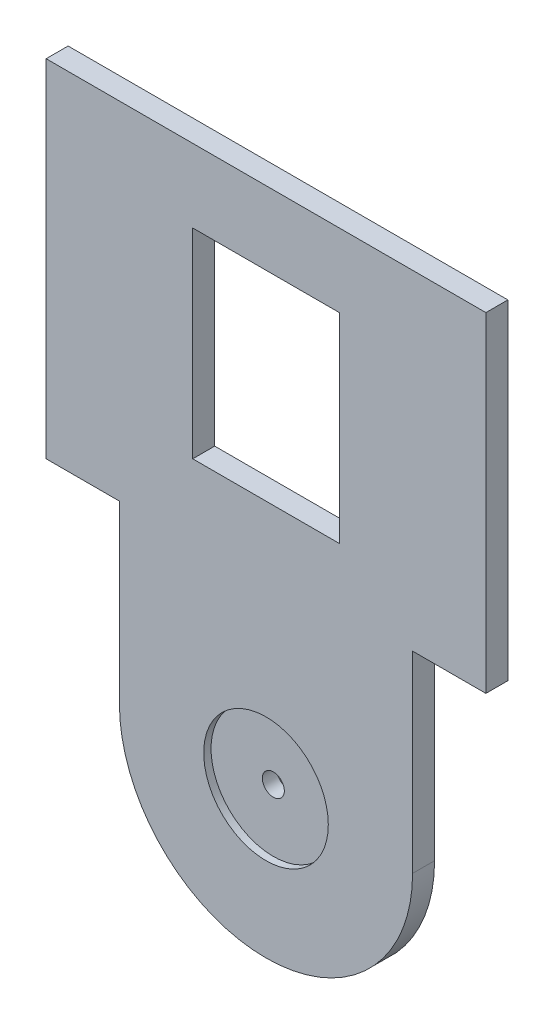
ISO-10303-21;
HEADER;
FILE_DESCRIPTION(('STEP AP214'),'2;1');
FILE_NAME('part.step','',(''),(''),'','','');
FILE_SCHEMA(('AUTOMOTIVE_DESIGN { 1 0 10303 214 1 1 1 1 }'));
ENDSEC;
DATA;
#1=APPLICATION_CONTEXT('core data for automotive mechanical design processes');
#2=APPLICATION_PROTOCOL_DEFINITION('international standard','automotive_design',2000,#1);
#3=PRODUCT_CONTEXT('',#1,'mechanical');
#4=PRODUCT('Part','Part','',(#3));
#5=PRODUCT_RELATED_PRODUCT_CATEGORY('part','',(#4));
#6=PRODUCT_DEFINITION_FORMATION('','',#4);
#7=PRODUCT_DEFINITION_CONTEXT('part definition',#1,'design');
#8=PRODUCT_DEFINITION('design','',#6,#7);
#9=PRODUCT_DEFINITION_SHAPE('','',#8);
#10=(LENGTH_UNIT() NAMED_UNIT(*) SI_UNIT(.MILLI.,.METRE.));
#11=(NAMED_UNIT(*) PLANE_ANGLE_UNIT() SI_UNIT($,.RADIAN.));
#12=(NAMED_UNIT(*) SI_UNIT($,.STERADIAN.) SOLID_ANGLE_UNIT());
#13=UNCERTAINTY_MEASURE_WITH_UNIT(LENGTH_MEASURE(1.E-05),#10,'distance_accuracy_value','');
#14=(GEOMETRIC_REPRESENTATION_CONTEXT(3) GLOBAL_UNCERTAINTY_ASSIGNED_CONTEXT((#13)) GLOBAL_UNIT_ASSIGNED_CONTEXT((#10,
#11,#12)) REPRESENTATION_CONTEXT('',''));
#15=CARTESIAN_POINT('',(0.,0.,0.));
#16=DIRECTION('',(0.,0.,1.));
#17=DIRECTION('',(1.,0.,0.));
#18=AXIS2_PLACEMENT_3D('',#15,#16,#17);
#19=CARTESIAN_POINT('',(-93.991811362998,10.9707882048787,3.));
#20=DIRECTION('',(0.,0.,-1.));
#21=DIRECTION('',(-1.,0.,0.));
#22=AXIS2_PLACEMENT_3D('',#19,#20,#21);
#23=CYLINDRICAL_SURFACE('',#22,1.5);
#24=CARTESIAN_POINT('',(-93.991811362998,10.9707882048787,0.));
#25=DIRECTION('',(0.,0.,1.));
#26=DIRECTION('',(1.,0.,0.));
#27=AXIS2_PLACEMENT_3D('',#24,#25,#26);
#28=CIRCLE('',#27,1.5);
#29=CARTESIAN_POINT('',(-92.491811362998,10.9707882048787,0.));
#30=VERTEX_POINT('',#29);
#31=EDGE_CURVE('E139',#30,#30,#28,.T.);
#32=ORIENTED_EDGE('',*,*,#31,.F.);
#33=EDGE_LOOP('',(#32));
#34=FACE_BOUND('',#33,.T.);
#35=CARTESIAN_POINT('',(-93.991811362998,10.9707882048787,2.));
#36=DIRECTION('',(0.,0.,1.));
#37=DIRECTION('',(1.,0.,0.));
#38=AXIS2_PLACEMENT_3D('',#35,#36,#37);
#39=CIRCLE('',#38,1.5);
#40=CARTESIAN_POINT('',(-92.491811362998,10.9707882048787,2.));
#41=VERTEX_POINT('',#40);
#42=EDGE_CURVE('E37',#41,#41,#39,.T.);
#43=ORIENTED_EDGE('',*,*,#42,.T.);
#44=EDGE_LOOP('',(#43));
#45=FACE_BOUND('',#44,.T.);
#46=ADVANCED_FACE('F33',(#34,#45),#23,.F.);
#47=CARTESIAN_POINT('',(-93.991811362998,10.9707882048787,3.));
#48=DIRECTION('',(0.,0.,1.));
#49=DIRECTION('',(1.,0.,0.));
#50=AXIS2_PLACEMENT_3D('',#47,#48,#49);
#51=PLANE('',#50);
#52=CARTESIAN_POINT('',(-93.991811362998,10.9707882048787,3.));
#53=DIRECTION('',(0.,0.,1.));
#54=DIRECTION('',(1.,0.,0.));
#55=AXIS2_PLACEMENT_3D('',#52,#53,#54);
#56=CIRCLE('',#55,8.50000000000001);
#57=CARTESIAN_POINT('',(-85.491811362998,10.9707882048787,3.));
#58=VERTEX_POINT('',#57);
#59=EDGE_CURVE('E313',#58,#58,#56,.T.);
#60=ORIENTED_EDGE('',*,*,#59,.F.);
#61=EDGE_LOOP('',(#60));
#62=FACE_BOUND('',#61,.T.);
#63=CARTESIAN_POINT('',(-93.991811362998,10.9707882048787,3.));
#64=DIRECTION('',(0.,0.,1.));
#65=DIRECTION('',(1.,0.,0.));
#66=AXIS2_PLACEMENT_3D('',#63,#64,#65);
#67=CIRCLE('',#66,20.);
#68=CARTESIAN_POINT('',(-113.991811362998,10.9707882048787,3.));
#69=VERTEX_POINT('',#68);
#70=CARTESIAN_POINT('',(-73.991811362998,10.9707882048787,3.));
#71=VERTEX_POINT('',#70);
#72=EDGE_CURVE('E164',#69,#71,#67,.T.);
#73=ORIENTED_EDGE('',*,*,#72,.T.);
#74=DIRECTION('',(0.,1.,0.));
#75=VECTOR('',#74,1.);
#76=CARTESIAN_POINT('',(-73.991811362998,10.9707882048787,3.));
#77=LINE('',#76,#75);
#78=CARTESIAN_POINT('',(-73.991811362998,37.236637471383,3.));
#79=VERTEX_POINT('',#78);
#80=EDGE_CURVE('E167',#71,#79,#77,.T.);
#81=ORIENTED_EDGE('',*,*,#80,.T.);
#82=DIRECTION('',(1.,0.,0.));
#83=VECTOR('',#82,1.);
#84=CARTESIAN_POINT('',(-73.991811362998,37.236637471383,3.));
#85=LINE('',#84,#83);
#86=CARTESIAN_POINT('',(-63.991811362998,37.236637471383,3.));
#87=VERTEX_POINT('',#86);
#88=EDGE_CURVE('E170',#79,#87,#85,.T.);
#89=ORIENTED_EDGE('',*,*,#88,.T.);
#90=DIRECTION('',(0.,1.,0.));
#91=VECTOR('',#90,1.);
#92=CARTESIAN_POINT('',(-63.991811362998,37.236637471383,3.));
#93=LINE('',#92,#91);
#94=CARTESIAN_POINT('',(-63.991811362998,82.236637471383,3.));
#95=VERTEX_POINT('',#94);
#96=EDGE_CURVE('E172',#87,#95,#93,.T.);
#97=ORIENTED_EDGE('',*,*,#96,.T.);
#98=DIRECTION('',(-1.,0.,0.));
#99=VECTOR('',#98,1.);
#100=CARTESIAN_POINT('',(-123.991811362998,82.2366374713831,3.));
#101=LINE('',#100,#99);
#102=CARTESIAN_POINT('',(-123.991811362998,82.2366374713831,3.));
#103=VERTEX_POINT('',#102);
#104=EDGE_CURVE('E174',#95,#103,#101,.T.);
#105=ORIENTED_EDGE('',*,*,#104,.T.);
#106=DIRECTION('',(0.,-1.,0.));
#107=VECTOR('',#106,1.);
#108=CARTESIAN_POINT('',(-123.991811362998,34.9581087916753,3.));
#109=LINE('',#108,#107);
#110=CARTESIAN_POINT('',(-123.991811362998,34.9581087916753,3.));
#111=VERTEX_POINT('',#110);
#112=EDGE_CURVE('E176',#103,#111,#109,.T.);
#113=ORIENTED_EDGE('',*,*,#112,.T.);
#114=DIRECTION('',(1.,0.,0.));
#115=VECTOR('',#114,1.);
#116=CARTESIAN_POINT('',(-113.991811362998,34.9581087916753,3.));
#117=LINE('',#116,#115);
#118=CARTESIAN_POINT('',(-113.991811362998,34.9581087916753,3.));
#119=VERTEX_POINT('',#118);
#120=EDGE_CURVE('E178',#111,#119,#117,.T.);
#121=ORIENTED_EDGE('',*,*,#120,.T.);
#122=DIRECTION('',(0.,-1.,0.));
#123=VECTOR('',#122,1.);
#124=CARTESIAN_POINT('',(-113.991811362998,10.9707882048787,3.));
#125=LINE('',#124,#123);
#126=EDGE_CURVE('E180',#119,#69,#125,.T.);
#127=ORIENTED_EDGE('',*,*,#126,.T.);
#128=EDGE_LOOP('',(#73,#81,#89,#97,#105,#113,#121,#127));
#129=FACE_BOUND('',#128,.T.);
#130=DIRECTION('',(1.,0.,0.));
#131=VECTOR('',#130,1.);
#132=CARTESIAN_POINT('',(-103.991811362998,44.9581087916753,3.));
#133=LINE('',#132,#131);
#134=CARTESIAN_POINT('',(-103.991811362998,44.9581087916753,3.));
#135=VERTEX_POINT('',#134);
#136=CARTESIAN_POINT('',(-83.991811362998,44.9581087916753,3.));
#137=VERTEX_POINT('',#136);
#138=EDGE_CURVE('E131',#135,#137,#133,.T.);
#139=ORIENTED_EDGE('',*,*,#138,.F.);
#140=DIRECTION('',(0.,-1.,0.));
#141=VECTOR('',#140,1.);
#142=CARTESIAN_POINT('',(-103.991811362998,72.236637471383,3.));
#143=LINE('',#142,#141);
#144=CARTESIAN_POINT('',(-103.991811362998,72.236637471383,3.));
#145=VERTEX_POINT('',#144);
#146=EDGE_CURVE('E123',#145,#135,#143,.T.);
#147=ORIENTED_EDGE('',*,*,#146,.F.);
#148=DIRECTION('',(-1.,0.,0.));
#149=VECTOR('',#148,1.);
#150=CARTESIAN_POINT('',(-103.991811362998,72.236637471383,3.));
#151=LINE('',#150,#149);
#152=CARTESIAN_POINT('',(-83.991811362998,72.236637471383,3.));
#153=VERTEX_POINT('',#152);
#154=EDGE_CURVE('E146',#153,#145,#151,.T.);
#155=ORIENTED_EDGE('',*,*,#154,.F.);
#156=DIRECTION('',(0.,1.,0.));
#157=VECTOR('',#156,1.);
#158=CARTESIAN_POINT('',(-83.991811362998,72.236637471383,3.));
#159=LINE('',#158,#157);
#160=EDGE_CURVE('E144',#137,#153,#159,.T.);
#161=ORIENTED_EDGE('',*,*,#160,.F.);
#162=EDGE_LOOP('',(#139,#147,#155,#161));
#163=FACE_BOUND('',#162,.T.);
#164=ADVANCED_FACE('F143',(#62,#129,#163),#51,.T.);
#165=CARTESIAN_POINT('',(-93.991811362998,10.9707882048787,0.));
#166=DIRECTION('',(0.,0.,1.));
#167=DIRECTION('',(1.,0.,0.));
#168=AXIS2_PLACEMENT_3D('',#165,#166,#167);
#169=PLANE('',#168);
#170=ORIENTED_EDGE('',*,*,#31,.T.);
#171=EDGE_LOOP('',(#170));
#172=FACE_BOUND('',#171,.T.);
#173=CARTESIAN_POINT('',(-93.991811362998,10.9707882048787,0.));
#174=DIRECTION('',(0.,0.,1.));
#175=DIRECTION('',(1.,0.,0.));
#176=AXIS2_PLACEMENT_3D('',#173,#174,#175);
#177=CIRCLE('',#176,20.);
#178=CARTESIAN_POINT('',(-113.991811362998,10.9707882048787,0.));
#179=VERTEX_POINT('',#178);
#180=CARTESIAN_POINT('',(-73.991811362998,10.9707882048787,0.));
#181=VERTEX_POINT('',#180);
#182=EDGE_CURVE('E163',#179,#181,#177,.T.);
#183=ORIENTED_EDGE('',*,*,#182,.F.);
#184=DIRECTION('',(0.,-1.,0.));
#185=VECTOR('',#184,1.);
#186=CARTESIAN_POINT('',(-113.991811362998,10.9707882048787,0.));
#187=LINE('',#186,#185);
#188=CARTESIAN_POINT('',(-113.991811362998,34.9581087916753,0.));
#189=VERTEX_POINT('',#188);
#190=EDGE_CURVE('E168',#189,#179,#187,.T.);
#191=ORIENTED_EDGE('',*,*,#190,.F.);
#192=DIRECTION('',(1.,0.,0.));
#193=VECTOR('',#192,1.);
#194=CARTESIAN_POINT('',(-113.991811362998,34.9581087916753,0.));
#195=LINE('',#194,#193);
#196=CARTESIAN_POINT('',(-123.991811362998,34.9581087916753,0.));
#197=VERTEX_POINT('',#196);
#198=EDGE_CURVE('E195',#197,#189,#195,.T.);
#199=ORIENTED_EDGE('',*,*,#198,.F.);
#200=DIRECTION('',(0.,-1.,0.));
#201=VECTOR('',#200,1.);
#202=CARTESIAN_POINT('',(-123.991811362998,34.9581087916753,0.));
#203=LINE('',#202,#201);
#204=CARTESIAN_POINT('',(-123.991811362998,82.2366374713831,0.));
#205=VERTEX_POINT('',#204);
#206=EDGE_CURVE('E193',#205,#197,#203,.T.);
#207=ORIENTED_EDGE('',*,*,#206,.F.);
#208=DIRECTION('',(-1.,0.,0.));
#209=VECTOR('',#208,1.);
#210=CARTESIAN_POINT('',(-123.991811362998,82.2366374713831,0.));
#211=LINE('',#210,#209);
#212=CARTESIAN_POINT('',(-63.991811362998,82.236637471383,0.));
#213=VERTEX_POINT('',#212);
#214=EDGE_CURVE('E191',#213,#205,#211,.T.);
#215=ORIENTED_EDGE('',*,*,#214,.F.);
#216=DIRECTION('',(0.,1.,0.));
#217=VECTOR('',#216,1.);
#218=CARTESIAN_POINT('',(-63.991811362998,37.236637471383,0.));
#219=LINE('',#218,#217);
#220=CARTESIAN_POINT('',(-63.991811362998,37.236637471383,0.));
#221=VERTEX_POINT('',#220);
#222=EDGE_CURVE('E189',#221,#213,#219,.T.);
#223=ORIENTED_EDGE('',*,*,#222,.F.);
#224=DIRECTION('',(1.,0.,0.));
#225=VECTOR('',#224,1.);
#226=CARTESIAN_POINT('',(-73.991811362998,37.236637471383,0.));
#227=LINE('',#226,#225);
#228=CARTESIAN_POINT('',(-73.991811362998,37.236637471383,0.));
#229=VERTEX_POINT('',#228);
#230=EDGE_CURVE('E187',#229,#221,#227,.T.);
#231=ORIENTED_EDGE('',*,*,#230,.F.);
#232=DIRECTION('',(0.,1.,0.));
#233=VECTOR('',#232,1.);
#234=CARTESIAN_POINT('',(-73.991811362998,10.9707882048787,0.));
#235=LINE('',#234,#233);
#236=EDGE_CURVE('E185',#181,#229,#235,.T.);
#237=ORIENTED_EDGE('',*,*,#236,.F.);
#238=EDGE_LOOP('',(#183,#191,#199,#207,#215,#223,#231,#237));
#239=FACE_BOUND('',#238,.T.);
#240=DIRECTION('',(0.,-1.,0.));
#241=VECTOR('',#240,1.);
#242=CARTESIAN_POINT('',(-103.991811362998,72.236637471383,0.));
#243=LINE('',#242,#241);
#244=CARTESIAN_POINT('',(-103.991811362998,72.236637471383,0.));
#245=VERTEX_POINT('',#244);
#246=CARTESIAN_POINT('',(-103.991811362998,44.9581087916753,0.));
#247=VERTEX_POINT('',#246);
#248=EDGE_CURVE('E57',#245,#247,#243,.T.);
#249=ORIENTED_EDGE('',*,*,#248,.T.);
#250=DIRECTION('',(1.,0.,0.));
#251=VECTOR('',#250,1.);
#252=CARTESIAN_POINT('',(-103.991811362998,44.9581087916753,0.));
#253=LINE('',#252,#251);
#254=CARTESIAN_POINT('',(-83.991811362998,44.9581087916753,0.));
#255=VERTEX_POINT('',#254);
#256=EDGE_CURVE('E138',#247,#255,#253,.T.);
#257=ORIENTED_EDGE('',*,*,#256,.T.);
#258=DIRECTION('',(0.,1.,0.));
#259=VECTOR('',#258,1.);
#260=CARTESIAN_POINT('',(-83.991811362998,72.236637471383,0.));
#261=LINE('',#260,#259);
#262=CARTESIAN_POINT('',(-83.991811362998,72.236637471383,0.));
#263=VERTEX_POINT('',#262);
#264=EDGE_CURVE('E153',#255,#263,#261,.T.);
#265=ORIENTED_EDGE('',*,*,#264,.T.);
#266=DIRECTION('',(-1.,0.,0.));
#267=VECTOR('',#266,1.);
#268=CARTESIAN_POINT('',(-103.991811362998,72.236637471383,0.));
#269=LINE('',#268,#267);
#270=EDGE_CURVE('E132',#263,#245,#269,.T.);
#271=ORIENTED_EDGE('',*,*,#270,.T.);
#272=EDGE_LOOP('',(#249,#257,#265,#271));
#273=FACE_BOUND('',#272,.T.);
#274=ADVANCED_FACE('F226',(#172,#239,#273),#169,.F.);
#275=CARTESIAN_POINT('',(-93.991811362998,10.9707882048787,3.));
#276=DIRECTION('',(0.,0.,-1.));
#277=DIRECTION('',(-1.,0.,0.));
#278=AXIS2_PLACEMENT_3D('',#275,#276,#277);
#279=CYLINDRICAL_SURFACE('',#278,20.);
#280=ORIENTED_EDGE('',*,*,#182,.T.);
#281=DIRECTION('',(0.,0.,-1.));
#282=VECTOR('',#281,1.);
#283=CARTESIAN_POINT('',(-73.991811362998,10.9707882048787,3.));
#284=LINE('',#283,#282);
#285=EDGE_CURVE('E11',#71,#181,#284,.T.);
#286=ORIENTED_EDGE('',*,*,#285,.F.);
#287=ORIENTED_EDGE('',*,*,#72,.F.);
#288=DIRECTION('',(0.,0.,-1.));
#289=VECTOR('',#288,1.);
#290=CARTESIAN_POINT('',(-113.991811362998,10.9707882048787,3.));
#291=LINE('',#290,#289);
#292=EDGE_CURVE('E182',#69,#179,#291,.T.);
#293=ORIENTED_EDGE('',*,*,#292,.T.);
#294=EDGE_LOOP('',(#280,#286,#287,#293));
#295=FACE_BOUND('',#294,.T.);
#296=ADVANCED_FACE('F35',(#295),#279,.T.);
#297=CARTESIAN_POINT('',(-73.991811362998,10.9707882048787,3.));
#298=DIRECTION('',(-1.,0.,0.));
#299=DIRECTION('',(0.,0.,1.));
#300=AXIS2_PLACEMENT_3D('',#297,#298,#299);
#301=PLANE('',#300);
#302=ORIENTED_EDGE('',*,*,#236,.T.);
#303=DIRECTION('',(0.,0.,-1.));
#304=VECTOR('',#303,1.);
#305=CARTESIAN_POINT('',(-73.991811362998,37.236637471383,3.));
#306=LINE('',#305,#304);
#307=EDGE_CURVE('E42',#79,#229,#306,.T.);
#308=ORIENTED_EDGE('',*,*,#307,.F.);
#309=ORIENTED_EDGE('',*,*,#80,.F.);
#310=ORIENTED_EDGE('',*,*,#285,.T.);
#311=EDGE_LOOP('',(#302,#308,#309,#310));
#312=FACE_BOUND('',#311,.T.);
#313=ADVANCED_FACE('F243',(#312),#301,.F.);
#314=CARTESIAN_POINT('',(-73.991811362998,37.236637471383,3.));
#315=DIRECTION('',(0.,1.,0.));
#316=DIRECTION('',(-1.,0.,0.));
#317=AXIS2_PLACEMENT_3D('',#314,#315,#316);
#318=PLANE('',#317);
#319=ORIENTED_EDGE('',*,*,#230,.T.);
#320=DIRECTION('',(0.,0.,-1.));
#321=VECTOR('',#320,1.);
#322=CARTESIAN_POINT('',(-63.991811362998,37.236637471383,3.));
#323=LINE('',#322,#321);
#324=EDGE_CURVE('E212',#87,#221,#323,.T.);
#325=ORIENTED_EDGE('',*,*,#324,.F.);
#326=ORIENTED_EDGE('',*,*,#88,.F.);
#327=ORIENTED_EDGE('',*,*,#307,.T.);
#328=EDGE_LOOP('',(#319,#325,#326,#327));
#329=FACE_BOUND('',#328,.T.);
#330=ADVANCED_FACE('F220',(#329),#318,.F.);
#331=CARTESIAN_POINT('',(-63.991811362998,37.236637471383,3.));
#332=DIRECTION('',(-1.,0.,0.));
#333=DIRECTION('',(0.,0.,1.));
#334=AXIS2_PLACEMENT_3D('',#331,#332,#333);
#335=PLANE('',#334);
#336=ORIENTED_EDGE('',*,*,#222,.T.);
#337=DIRECTION('',(0.,0.,-1.));
#338=VECTOR('',#337,1.);
#339=CARTESIAN_POINT('',(-63.991811362998,82.236637471383,3.));
#340=LINE('',#339,#338);
#341=EDGE_CURVE('E209',#95,#213,#340,.T.);
#342=ORIENTED_EDGE('',*,*,#341,.F.);
#343=ORIENTED_EDGE('',*,*,#96,.F.);
#344=ORIENTED_EDGE('',*,*,#324,.T.);
#345=EDGE_LOOP('',(#336,#342,#343,#344));
#346=FACE_BOUND('',#345,.T.);
#347=ADVANCED_FACE('F232',(#346),#335,.F.);
#348=CARTESIAN_POINT('',(-123.991811362998,82.2366374713831,3.));
#349=DIRECTION('',(0.,-1.,0.));
#350=DIRECTION('',(1.,0.,0.));
#351=AXIS2_PLACEMENT_3D('',#348,#349,#350);
#352=PLANE('',#351);
#353=ORIENTED_EDGE('',*,*,#214,.T.);
#354=DIRECTION('',(0.,0.,-1.));
#355=VECTOR('',#354,1.);
#356=CARTESIAN_POINT('',(-123.991811362998,82.2366374713831,3.));
#357=LINE('',#356,#355);
#358=EDGE_CURVE('E206',#103,#205,#357,.T.);
#359=ORIENTED_EDGE('',*,*,#358,.F.);
#360=ORIENTED_EDGE('',*,*,#104,.F.);
#361=ORIENTED_EDGE('',*,*,#341,.T.);
#362=EDGE_LOOP('',(#353,#359,#360,#361));
#363=FACE_BOUND('',#362,.T.);
#364=ADVANCED_FACE('F236',(#363),#352,.F.);
#365=CARTESIAN_POINT('',(-123.991811362998,34.9581087916753,3.));
#366=DIRECTION('',(1.,0.,0.));
#367=DIRECTION('',(0.,0.,-1.));
#368=AXIS2_PLACEMENT_3D('',#365,#366,#367);
#369=PLANE('',#368);
#370=ORIENTED_EDGE('',*,*,#206,.T.);
#371=DIRECTION('',(0.,0.,-1.));
#372=VECTOR('',#371,1.);
#373=CARTESIAN_POINT('',(-123.991811362998,34.9581087916753,3.));
#374=LINE('',#373,#372);
#375=EDGE_CURVE('E203',#111,#197,#374,.T.);
#376=ORIENTED_EDGE('',*,*,#375,.F.);
#377=ORIENTED_EDGE('',*,*,#112,.F.);
#378=ORIENTED_EDGE('',*,*,#358,.T.);
#379=EDGE_LOOP('',(#370,#376,#377,#378));
#380=FACE_BOUND('',#379,.T.);
#381=ADVANCED_FACE('F256',(#380),#369,.F.);
#382=CARTESIAN_POINT('',(-113.991811362998,34.9581087916753,3.));
#383=DIRECTION('',(0.,1.,0.));
#384=DIRECTION('',(0.,0.,1.));
#385=AXIS2_PLACEMENT_3D('',#382,#383,#384);
#386=PLANE('',#385);
#387=ORIENTED_EDGE('',*,*,#198,.T.);
#388=DIRECTION('',(0.,0.,-1.));
#389=VECTOR('',#388,1.);
#390=CARTESIAN_POINT('',(-113.991811362998,34.9581087916753,3.));
#391=LINE('',#390,#389);
#392=EDGE_CURVE('E200',#119,#189,#391,.T.);
#393=ORIENTED_EDGE('',*,*,#392,.F.);
#394=ORIENTED_EDGE('',*,*,#120,.F.);
#395=ORIENTED_EDGE('',*,*,#375,.T.);
#396=EDGE_LOOP('',(#387,#393,#394,#395));
#397=FACE_BOUND('',#396,.T.);
#398=ADVANCED_FACE('F254',(#397),#386,.F.);
#399=CARTESIAN_POINT('',(-113.991811362998,10.9707882048787,3.));
#400=DIRECTION('',(1.,0.,0.));
#401=DIRECTION('',(0.,0.,-1.));
#402=AXIS2_PLACEMENT_3D('',#399,#400,#401);
#403=PLANE('',#402);
#404=ORIENTED_EDGE('',*,*,#190,.T.);
#405=ORIENTED_EDGE('',*,*,#292,.F.);
#406=ORIENTED_EDGE('',*,*,#126,.F.);
#407=ORIENTED_EDGE('',*,*,#392,.T.);
#408=EDGE_LOOP('',(#404,#405,#406,#407));
#409=FACE_BOUND('',#408,.T.);
#410=ADVANCED_FACE('F249',(#409),#403,.F.);
#411=CARTESIAN_POINT('',(-103.991811362998,72.236637471383,3.));
#412=DIRECTION('',(1.,0.,0.));
#413=DIRECTION('',(0.,0.,-1.));
#414=AXIS2_PLACEMENT_3D('',#411,#412,#413);
#415=PLANE('',#414);
#416=ORIENTED_EDGE('',*,*,#248,.F.);
#417=DIRECTION('',(0.,0.,-1.));
#418=VECTOR('',#417,1.);
#419=CARTESIAN_POINT('',(-103.991811362998,72.236637471383,3.));
#420=LINE('',#419,#418);
#421=EDGE_CURVE('E127',#145,#245,#420,.T.);
#422=ORIENTED_EDGE('',*,*,#421,.F.);
#423=ORIENTED_EDGE('',*,*,#146,.T.);
#424=DIRECTION('',(0.,0.,-1.));
#425=VECTOR('',#424,1.);
#426=CARTESIAN_POINT('',(-103.991811362998,44.9581087916753,3.));
#427=LINE('',#426,#425);
#428=EDGE_CURVE('E126',#135,#247,#427,.T.);
#429=ORIENTED_EDGE('',*,*,#428,.T.);
#430=EDGE_LOOP('',(#416,#422,#423,#429));
#431=FACE_BOUND('',#430,.T.);
#432=ADVANCED_FACE('F125',(#431),#415,.T.);
#433=CARTESIAN_POINT('',(-103.991811362998,44.9581087916753,3.));
#434=DIRECTION('',(0.,1.,0.));
#435=DIRECTION('',(0.,0.,1.));
#436=AXIS2_PLACEMENT_3D('',#433,#434,#435);
#437=PLANE('',#436);
#438=ORIENTED_EDGE('',*,*,#256,.F.);
#439=ORIENTED_EDGE('',*,*,#428,.F.);
#440=ORIENTED_EDGE('',*,*,#138,.T.);
#441=DIRECTION('',(0.,0.,-1.));
#442=VECTOR('',#441,1.);
#443=CARTESIAN_POINT('',(-83.991811362998,44.9581087916753,3.));
#444=LINE('',#443,#442);
#445=EDGE_CURVE('E140',#137,#255,#444,.T.);
#446=ORIENTED_EDGE('',*,*,#445,.T.);
#447=EDGE_LOOP('',(#438,#439,#440,#446));
#448=FACE_BOUND('',#447,.T.);
#449=ADVANCED_FACE('F135',(#448),#437,.T.);
#450=CARTESIAN_POINT('',(-83.991811362998,72.236637471383,3.));
#451=DIRECTION('',(-1.,0.,0.));
#452=DIRECTION('',(0.,0.,1.));
#453=AXIS2_PLACEMENT_3D('',#450,#451,#452);
#454=PLANE('',#453);
#455=ORIENTED_EDGE('',*,*,#264,.F.);
#456=ORIENTED_EDGE('',*,*,#445,.F.);
#457=ORIENTED_EDGE('',*,*,#160,.T.);
#458=DIRECTION('',(0.,0.,-1.));
#459=VECTOR('',#458,1.);
#460=CARTESIAN_POINT('',(-83.991811362998,72.236637471383,3.));
#461=LINE('',#460,#459);
#462=EDGE_CURVE('E49',#153,#263,#461,.T.);
#463=ORIENTED_EDGE('',*,*,#462,.T.);
#464=EDGE_LOOP('',(#455,#456,#457,#463));
#465=FACE_BOUND('',#464,.T.);
#466=ADVANCED_FACE('F288',(#465),#454,.T.);
#467=CARTESIAN_POINT('',(-103.991811362998,72.236637471383,3.));
#468=DIRECTION('',(0.,-1.,0.));
#469=DIRECTION('',(0.,0.,-1.));
#470=AXIS2_PLACEMENT_3D('',#467,#468,#469);
#471=PLANE('',#470);
#472=ORIENTED_EDGE('',*,*,#270,.F.);
#473=ORIENTED_EDGE('',*,*,#462,.F.);
#474=ORIENTED_EDGE('',*,*,#154,.T.);
#475=ORIENTED_EDGE('',*,*,#421,.T.);
#476=EDGE_LOOP('',(#472,#473,#474,#475));
#477=FACE_BOUND('',#476,.T.);
#478=ADVANCED_FACE('F292',(#477),#471,.T.);
#479=CARTESIAN_POINT('',(-93.991811362998,10.9707882048787,2.));
#480=DIRECTION('',(0.,0.,1.));
#481=DIRECTION('',(1.,0.,0.));
#482=AXIS2_PLACEMENT_3D('',#479,#480,#481);
#483=CYLINDRICAL_SURFACE('',#482,8.50000000000001);
#484=CARTESIAN_POINT('',(-93.991811362998,10.9707882048787,2.));
#485=DIRECTION('',(0.,0.,1.));
#486=DIRECTION('',(1.,0.,0.));
#487=AXIS2_PLACEMENT_3D('',#484,#485,#486);
#488=CIRCLE('',#487,8.50000000000001);
#489=CARTESIAN_POINT('',(-85.491811362998,10.9707882048787,2.));
#490=VERTEX_POINT('',#489);
#491=EDGE_CURVE('E312',#490,#490,#488,.T.);
#492=ORIENTED_EDGE('',*,*,#491,.F.);
#493=EDGE_LOOP('',(#492));
#494=FACE_BOUND('',#493,.T.);
#495=ORIENTED_EDGE('',*,*,#59,.T.);
#496=EDGE_LOOP('',(#495));
#497=FACE_BOUND('',#496,.T.);
#498=ADVANCED_FACE('F298',(#494,#497),#483,.F.);
#499=CARTESIAN_POINT('',(-93.991811362998,10.9707882048787,2.));
#500=DIRECTION('',(0.,0.,1.));
#501=DIRECTION('',(1.,0.,0.));
#502=AXIS2_PLACEMENT_3D('',#499,#500,#501);
#503=PLANE('',#502);
#504=ORIENTED_EDGE('',*,*,#42,.F.);
#505=EDGE_LOOP('',(#504));
#506=FACE_BOUND('',#505,.T.);
#507=ORIENTED_EDGE('',*,*,#491,.T.);
#508=EDGE_LOOP('',(#507));
#509=FACE_BOUND('',#508,.T.);
#510=ADVANCED_FACE('F301',(#506,#509),#503,.T.);
#511=CLOSED_SHELL('',(#46,#164,#274,#296,#313,#330,#347,#364,#381,#398,#410,#432,#449,#466,#478,
#498,#510));
#512=MANIFOLD_SOLID_BREP('B2',#511);
#513=ADVANCED_BREP_SHAPE_REPRESENTATION('',(#18,#512),#14);
#514=SHAPE_DEFINITION_REPRESENTATION(#9,#513);
ENDSEC;
END-ISO-10303-21;
